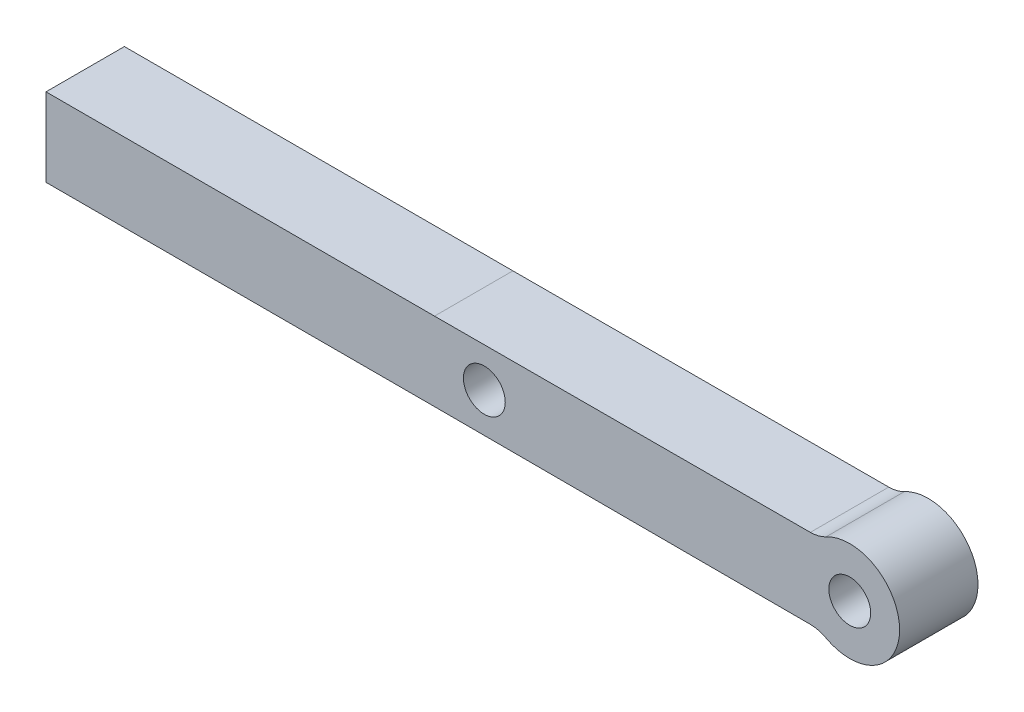
ISO-10303-21;
HEADER;
FILE_DESCRIPTION(('STEP AP214'),'2;1');
FILE_NAME('part.step','',(''),(''),'','','');
FILE_SCHEMA(('AUTOMOTIVE_DESIGN { 1 0 10303 214 1 1 1 1 }'));
ENDSEC;
DATA;
#1=APPLICATION_CONTEXT('core data for automotive mechanical design processes');
#2=APPLICATION_PROTOCOL_DEFINITION('international standard','automotive_design',2000,#1);
#3=PRODUCT_CONTEXT('',#1,'mechanical');
#4=PRODUCT('Part','Part','',(#3));
#5=PRODUCT_RELATED_PRODUCT_CATEGORY('part','',(#4));
#6=PRODUCT_DEFINITION_FORMATION('','',#4);
#7=PRODUCT_DEFINITION_CONTEXT('part definition',#1,'design');
#8=PRODUCT_DEFINITION('design','',#6,#7);
#9=PRODUCT_DEFINITION_SHAPE('','',#8);
#10=(LENGTH_UNIT() NAMED_UNIT(*) SI_UNIT(.MILLI.,.METRE.));
#11=(NAMED_UNIT(*) PLANE_ANGLE_UNIT() SI_UNIT($,.RADIAN.));
#12=(NAMED_UNIT(*) SI_UNIT($,.STERADIAN.) SOLID_ANGLE_UNIT());
#13=UNCERTAINTY_MEASURE_WITH_UNIT(LENGTH_MEASURE(1.E-05),#10,'distance_accuracy_value','');
#14=(GEOMETRIC_REPRESENTATION_CONTEXT(3) GLOBAL_UNCERTAINTY_ASSIGNED_CONTEXT((#13)) GLOBAL_UNIT_ASSIGNED_CONTEXT((#10,
#11,#12)) REPRESENTATION_CONTEXT('',''));
#15=CARTESIAN_POINT('',(0.,0.,0.));
#16=DIRECTION('',(0.,0.,1.));
#17=DIRECTION('',(1.,0.,0.));
#18=AXIS2_PLACEMENT_3D('',#15,#16,#17);
#19=CARTESIAN_POINT('',(-3.01841433356619,5.586740991931,5.9944));
#20=DIRECTION('',(0.,0.,-1.));
#21=DIRECTION('',(-1.,0.,0.));
#22=AXIS2_PLACEMENT_3D('',#19,#20,#21);
#23=PLANE('',#22);
#24=CARTESIAN_POINT('',(-3.01841433356619,5.586740991931,5.9944));
#25=DIRECTION('',(0.,0.,-1.));
#26=DIRECTION('',(-1.,0.,0.));
#27=AXIS2_PLACEMENT_3D('',#24,#25,#26);
#28=CIRCLE('',#27,2.54);
#29=CARTESIAN_POINT('',(-1.81104860013972,3.3520445951586,5.9944));
#30=VERTEX_POINT('',#29);
#31=CARTESIAN_POINT('',(-3.01403502973043,3.04674476719012,5.9944));
#32=VERTEX_POINT('',#31);
#33=EDGE_CURVE('E147',#30,#32,#28,.T.);
#34=ORIENTED_EDGE('',*,*,#33,.T.);
#35=DIRECTION('',(-0.999998513677511,-0.0017241353684095,0.));
#36=VECTOR('',#35,1.);
#37=CARTESIAN_POINT('',(-31.75,2.9972,5.9944));
#38=LINE('',#37,#36);
#39=CARTESIAN_POINT('',(-31.75,2.9972,5.9944));
#40=VERTEX_POINT('',#39);
#41=EDGE_CURVE('E93',#32,#40,#38,.T.);
#42=ORIENTED_EDGE('',*,*,#41,.T.);
#43=DIRECTION('',(-1.,0.,0.));
#44=VECTOR('',#43,1.);
#45=CARTESIAN_POINT('',(-31.75,2.9972,5.9944));
#46=LINE('',#45,#44);
#47=CARTESIAN_POINT('',(-61.4537217435414,2.9972,5.9944));
#48=VERTEX_POINT('',#47);
#49=EDGE_CURVE('E161',#40,#48,#46,.T.);
#50=ORIENTED_EDGE('',*,*,#49,.T.);
#51=DIRECTION('',(0.,-1.,0.));
#52=VECTOR('',#51,1.);
#53=CARTESIAN_POINT('',(-61.4537217435414,2.9972,5.9944));
#54=LINE('',#53,#52);
#55=CARTESIAN_POINT('',(-61.4537217435414,-2.9972,5.9944));
#56=VERTEX_POINT('',#55);
#57=EDGE_CURVE('E175',#48,#56,#54,.T.);
#58=ORIENTED_EDGE('',*,*,#57,.T.);
#59=DIRECTION('',(1.,0.,0.));
#60=VECTOR('',#59,1.);
#61=CARTESIAN_POINT('',(-61.4537217435414,-2.9972,5.9944));
#62=LINE('',#61,#60);
#63=CARTESIAN_POINT('',(-31.75,-2.9972,5.9944));
#64=VERTEX_POINT('',#63);
#65=EDGE_CURVE('E112',#56,#64,#62,.T.);
#66=ORIENTED_EDGE('',*,*,#65,.T.);
#67=DIRECTION('',(0.999998513677511,-0.0017241353684095,0.));
#68=VECTOR('',#67,1.);
#69=CARTESIAN_POINT('',(-31.75,-2.9972,5.9944));
#70=LINE('',#69,#68);
#71=CARTESIAN_POINT('',(-3.01403502973043,-3.04674476719012,5.9944));
#72=VERTEX_POINT('',#71);
#73=EDGE_CURVE('E106',#64,#72,#70,.T.);
#74=ORIENTED_EDGE('',*,*,#73,.T.);
#75=CARTESIAN_POINT('',(-3.01841433356619,-5.586740991931,5.9944));
#76=DIRECTION('',(0.,0.,-1.));
#77=DIRECTION('',(1.,0.,0.));
#78=AXIS2_PLACEMENT_3D('',#75,#76,#77);
#79=CIRCLE('',#78,2.54);
#80=CARTESIAN_POINT('',(-1.81104860013972,-3.3520445951586,5.9944));
#81=VERTEX_POINT('',#80);
#82=EDGE_CURVE('E110',#72,#81,#79,.T.);
#83=ORIENTED_EDGE('',*,*,#82,.T.);
#84=CARTESIAN_POINT('',(0.,0.,5.9944));
#85=DIRECTION('',(0.,0.,1.));
#86=DIRECTION('',(1.,0.,0.));
#87=AXIS2_PLACEMENT_3D('',#84,#85,#86);
#88=CIRCLE('',#87,3.81);
#89=EDGE_CURVE('E50',#81,#30,#88,.T.);
#90=ORIENTED_EDGE('',*,*,#89,.T.);
#91=EDGE_LOOP('',(#34,#42,#50,#58,#66,#74,#83,#90));
#92=FACE_BOUND('',#91,.T.);
#93=CARTESIAN_POINT('',(0.,0.,5.9944));
#94=DIRECTION('',(0.,0.,1.));
#95=DIRECTION('',(1.,0.,0.));
#96=AXIS2_PLACEMENT_3D('',#93,#94,#95);
#97=CIRCLE('',#96,1.6);
#98=CARTESIAN_POINT('',(1.6,0.,5.9944));
#99=VERTEX_POINT('',#98);
#100=EDGE_CURVE('E134',#99,#99,#97,.T.);
#101=ORIENTED_EDGE('',*,*,#100,.F.);
#102=EDGE_LOOP('',(#101));
#103=FACE_BOUND('',#102,.T.);
#104=CARTESIAN_POINT('',(-27.94,0.,5.9944));
#105=DIRECTION('',(0.,0.,1.));
#106=DIRECTION('',(1.,0.,0.));
#107=AXIS2_PLACEMENT_3D('',#104,#105,#106);
#108=CIRCLE('',#107,1.6);
#109=CARTESIAN_POINT('',(-26.34,0.,5.9944));
#110=VERTEX_POINT('',#109);
#111=EDGE_CURVE('E184',#110,#110,#108,.T.);
#112=ORIENTED_EDGE('',*,*,#111,.F.);
#113=EDGE_LOOP('',(#112));
#114=FACE_BOUND('',#113,.T.);
#115=ADVANCED_FACE('F33',(#92,#103,#114),#23,.F.);
#116=CARTESIAN_POINT('',(-3.01841433356619,5.586740991931,0.));
#117=DIRECTION('',(0.,0.,-1.));
#118=DIRECTION('',(-1.,0.,0.));
#119=AXIS2_PLACEMENT_3D('',#116,#117,#118);
#120=PLANE('',#119);
#121=CARTESIAN_POINT('',(0.,0.,0.));
#122=DIRECTION('',(0.,0.,1.));
#123=DIRECTION('',(1.,0.,0.));
#124=AXIS2_PLACEMENT_3D('',#121,#122,#123);
#125=CIRCLE('',#124,1.6);
#126=CARTESIAN_POINT('',(1.6,0.,0.));
#127=VERTEX_POINT('',#126);
#128=EDGE_CURVE('E181',#127,#127,#125,.T.);
#129=ORIENTED_EDGE('',*,*,#128,.T.);
#130=EDGE_LOOP('',(#129));
#131=FACE_BOUND('',#130,.T.);
#132=CARTESIAN_POINT('',(-3.01841433356619,5.586740991931,0.));
#133=DIRECTION('',(0.,0.,-1.));
#134=DIRECTION('',(-1.,0.,0.));
#135=AXIS2_PLACEMENT_3D('',#132,#133,#134);
#136=CIRCLE('',#135,2.54);
#137=CARTESIAN_POINT('',(-1.81104860013972,3.3520445951586,0.));
#138=VERTEX_POINT('',#137);
#139=CARTESIAN_POINT('',(-3.01403502973043,3.04674476719012,0.));
#140=VERTEX_POINT('',#139);
#141=EDGE_CURVE('E130',#138,#140,#136,.T.);
#142=ORIENTED_EDGE('',*,*,#141,.F.);
#143=CARTESIAN_POINT('',(0.,0.,0.));
#144=DIRECTION('',(0.,0.,1.));
#145=DIRECTION('',(1.,0.,0.));
#146=AXIS2_PLACEMENT_3D('',#143,#144,#145);
#147=CIRCLE('',#146,3.81);
#148=CARTESIAN_POINT('',(-1.81104860013972,-3.3520445951586,0.));
#149=VERTEX_POINT('',#148);
#150=EDGE_CURVE('E85',#149,#138,#147,.T.);
#151=ORIENTED_EDGE('',*,*,#150,.F.);
#152=CARTESIAN_POINT('',(-3.01841433356619,-5.586740991931,0.));
#153=DIRECTION('',(0.,0.,-1.));
#154=DIRECTION('',(1.,0.,0.));
#155=AXIS2_PLACEMENT_3D('',#152,#153,#154);
#156=CIRCLE('',#155,2.54);
#157=CARTESIAN_POINT('',(-3.01403502973043,-3.04674476719012,0.));
#158=VERTEX_POINT('',#157);
#159=EDGE_CURVE('E79',#158,#149,#156,.T.);
#160=ORIENTED_EDGE('',*,*,#159,.F.);
#161=DIRECTION('',(0.999998513677511,-0.0017241353684095,0.));
#162=VECTOR('',#161,1.);
#163=CARTESIAN_POINT('',(-31.75,-2.9972,0.));
#164=LINE('',#163,#162);
#165=CARTESIAN_POINT('',(-31.75,-2.9972,0.));
#166=VERTEX_POINT('',#165);
#167=EDGE_CURVE('E120',#166,#158,#164,.T.);
#168=ORIENTED_EDGE('',*,*,#167,.F.);
#169=DIRECTION('',(1.,0.,0.));
#170=VECTOR('',#169,1.);
#171=CARTESIAN_POINT('',(-37.7444,-2.9972,0.));
#172=LINE('',#171,#170);
#173=CARTESIAN_POINT('',(-61.4537217435414,-2.9972,0.));
#174=VERTEX_POINT('',#173);
#175=EDGE_CURVE('E142',#174,#166,#172,.T.);
#176=ORIENTED_EDGE('',*,*,#175,.F.);
#177=DIRECTION('',(0.,-1.,0.));
#178=VECTOR('',#177,1.);
#179=CARTESIAN_POINT('',(-61.4537217435414,2.9972,0.));
#180=LINE('',#179,#178);
#181=CARTESIAN_POINT('',(-61.4537217435414,2.9972,0.));
#182=VERTEX_POINT('',#181);
#183=EDGE_CURVE('E139',#182,#174,#180,.T.);
#184=ORIENTED_EDGE('',*,*,#183,.F.);
#185=DIRECTION('',(-1.,0.,0.));
#186=VECTOR('',#185,1.);
#187=CARTESIAN_POINT('',(-42.4037217435414,2.9972,0.));
#188=LINE('',#187,#186);
#189=CARTESIAN_POINT('',(-31.75,2.9972,0.));
#190=VERTEX_POINT('',#189);
#191=EDGE_CURVE('E137',#190,#182,#188,.T.);
#192=ORIENTED_EDGE('',*,*,#191,.F.);
#193=DIRECTION('',(-0.999998513677511,-0.0017241353684095,0.));
#194=VECTOR('',#193,1.);
#195=CARTESIAN_POINT('',(-31.75,2.9972,0.));
#196=LINE('',#195,#194);
#197=EDGE_CURVE('E133',#140,#190,#196,.T.);
#198=ORIENTED_EDGE('',*,*,#197,.F.);
#199=EDGE_LOOP('',(#142,#151,#160,#168,#176,#184,#192,#198));
#200=FACE_BOUND('',#199,.T.);
#201=CARTESIAN_POINT('',(-27.94,0.,0.));
#202=DIRECTION('',(0.,0.,1.));
#203=DIRECTION('',(1.,0.,0.));
#204=AXIS2_PLACEMENT_3D('',#201,#202,#203);
#205=CIRCLE('',#204,1.6);
#206=CARTESIAN_POINT('',(-26.34,0.,0.));
#207=VERTEX_POINT('',#206);
#208=EDGE_CURVE('E187',#207,#207,#205,.T.);
#209=ORIENTED_EDGE('',*,*,#208,.T.);
#210=EDGE_LOOP('',(#209));
#211=FACE_BOUND('',#210,.T.);
#212=ADVANCED_FACE('F166',(#131,#200,#211),#120,.T.);
#213=CARTESIAN_POINT('',(-3.01841433356619,5.586740991931,5.9944));
#214=DIRECTION('',(0.,0.,-1.));
#215=DIRECTION('',(-1.,0.,0.));
#216=AXIS2_PLACEMENT_3D('',#213,#214,#215);
#217=CYLINDRICAL_SURFACE('',#216,2.54);
#218=ORIENTED_EDGE('',*,*,#141,.T.);
#219=DIRECTION('',(0.,0.,-1.));
#220=VECTOR('',#219,1.);
#221=CARTESIAN_POINT('',(-3.01403502973043,3.04674476719012,5.9944));
#222=LINE('',#221,#220);
#223=EDGE_CURVE('E11',#32,#140,#222,.T.);
#224=ORIENTED_EDGE('',*,*,#223,.F.);
#225=ORIENTED_EDGE('',*,*,#33,.F.);
#226=DIRECTION('',(0.,0.,-1.));
#227=VECTOR('',#226,1.);
#228=CARTESIAN_POINT('',(-1.81104860013972,3.3520445951586,5.9944));
#229=LINE('',#228,#227);
#230=EDGE_CURVE('E126',#30,#138,#229,.T.);
#231=ORIENTED_EDGE('',*,*,#230,.T.);
#232=EDGE_LOOP('',(#218,#224,#225,#231));
#233=FACE_BOUND('',#232,.T.);
#234=ADVANCED_FACE('F35',(#233),#217,.F.);
#235=CARTESIAN_POINT('',(-31.75,2.9972,5.9944));
#236=DIRECTION('',(0.0017241353684095,-0.999998513677511,0.));
#237=DIRECTION('',(0.999998513677511,0.0017241353684095,0.));
#238=AXIS2_PLACEMENT_3D('',#235,#236,#237);
#239=PLANE('',#238);
#240=ORIENTED_EDGE('',*,*,#197,.T.);
#241=DIRECTION('',(0.,0.,-1.));
#242=VECTOR('',#241,1.);
#243=CARTESIAN_POINT('',(-31.75,2.9972,5.9944));
#244=LINE('',#243,#242);
#245=EDGE_CURVE('E42',#40,#190,#244,.T.);
#246=ORIENTED_EDGE('',*,*,#245,.F.);
#247=ORIENTED_EDGE('',*,*,#41,.F.);
#248=ORIENTED_EDGE('',*,*,#223,.T.);
#249=EDGE_LOOP('',(#240,#246,#247,#248));
#250=FACE_BOUND('',#249,.T.);
#251=ADVANCED_FACE('F162',(#250),#239,.F.);
#252=CARTESIAN_POINT('',(-42.4037217435414,2.9972,5.9944));
#253=DIRECTION('',(0.,-1.,0.));
#254=DIRECTION('',(1.,0.,0.));
#255=AXIS2_PLACEMENT_3D('',#252,#253,#254);
#256=PLANE('',#255);
#257=ORIENTED_EDGE('',*,*,#191,.T.);
#258=DIRECTION('',(0.,0.,-1.));
#259=VECTOR('',#258,1.);
#260=CARTESIAN_POINT('',(-61.4537217435414,2.9972,5.9944));
#261=LINE('',#260,#259);
#262=EDGE_CURVE('E154',#48,#182,#261,.T.);
#263=ORIENTED_EDGE('',*,*,#262,.F.);
#264=ORIENTED_EDGE('',*,*,#49,.F.);
#265=ORIENTED_EDGE('',*,*,#245,.T.);
#266=EDGE_LOOP('',(#257,#263,#264,#265));
#267=FACE_BOUND('',#266,.T.);
#268=ADVANCED_FACE('F159',(#267),#256,.F.);
#269=CARTESIAN_POINT('',(-61.4537217435414,2.9972,5.9944));
#270=DIRECTION('',(1.,0.,0.));
#271=DIRECTION('',(0.,0.,-1.));
#272=AXIS2_PLACEMENT_3D('',#269,#270,#271);
#273=PLANE('',#272);
#274=ORIENTED_EDGE('',*,*,#183,.T.);
#275=DIRECTION('',(0.,0.,-1.));
#276=VECTOR('',#275,1.);
#277=CARTESIAN_POINT('',(-61.4537217435414,-2.9972,5.9944));
#278=LINE('',#277,#276);
#279=EDGE_CURVE('E151',#56,#174,#278,.T.);
#280=ORIENTED_EDGE('',*,*,#279,.F.);
#281=ORIENTED_EDGE('',*,*,#57,.F.);
#282=ORIENTED_EDGE('',*,*,#262,.T.);
#283=EDGE_LOOP('',(#274,#280,#281,#282));
#284=FACE_BOUND('',#283,.T.);
#285=ADVANCED_FACE('F171',(#284),#273,.F.);
#286=CARTESIAN_POINT('',(-37.7444,-2.9972,5.9944));
#287=DIRECTION('',(0.,1.,0.));
#288=DIRECTION('',(0.,0.,1.));
#289=AXIS2_PLACEMENT_3D('',#286,#287,#288);
#290=PLANE('',#289);
#291=ORIENTED_EDGE('',*,*,#175,.T.);
#292=DIRECTION('',(0.,0.,-1.));
#293=VECTOR('',#292,1.);
#294=CARTESIAN_POINT('',(-31.75,-2.9972,5.9944));
#295=LINE('',#294,#293);
#296=EDGE_CURVE('E121',#64,#166,#295,.T.);
#297=ORIENTED_EDGE('',*,*,#296,.F.);
#298=ORIENTED_EDGE('',*,*,#65,.F.);
#299=ORIENTED_EDGE('',*,*,#279,.T.);
#300=EDGE_LOOP('',(#291,#297,#298,#299));
#301=FACE_BOUND('',#300,.T.);
#302=ADVANCED_FACE('F174',(#301),#290,.F.);
#303=CARTESIAN_POINT('',(-31.75,-2.9972,5.9944));
#304=DIRECTION('',(0.0017241353684095,0.999998513677511,0.));
#305=DIRECTION('',(-0.999998513677511,0.0017241353684095,0.));
#306=AXIS2_PLACEMENT_3D('',#303,#304,#305);
#307=PLANE('',#306);
#308=ORIENTED_EDGE('',*,*,#167,.T.);
#309=DIRECTION('',(0.,0.,-1.));
#310=VECTOR('',#309,1.);
#311=CARTESIAN_POINT('',(-3.01403502973043,-3.04674476719012,5.9944));
#312=LINE('',#311,#310);
#313=EDGE_CURVE('E117',#72,#158,#312,.T.);
#314=ORIENTED_EDGE('',*,*,#313,.F.);
#315=ORIENTED_EDGE('',*,*,#73,.F.);
#316=ORIENTED_EDGE('',*,*,#296,.T.);
#317=EDGE_LOOP('',(#308,#314,#315,#316));
#318=FACE_BOUND('',#317,.T.);
#319=ADVANCED_FACE('F118',(#318),#307,.F.);
#320=CARTESIAN_POINT('',(-3.01841433356619,-5.586740991931,5.9944));
#321=DIRECTION('',(0.,0.,-1.));
#322=DIRECTION('',(-1.,0.,0.));
#323=AXIS2_PLACEMENT_3D('',#320,#321,#322);
#324=CYLINDRICAL_SURFACE('',#323,2.54);
#325=ORIENTED_EDGE('',*,*,#159,.T.);
#326=DIRECTION('',(0.,0.,-1.));
#327=VECTOR('',#326,1.);
#328=CARTESIAN_POINT('',(-1.81104860013972,-3.3520445951586,5.9944));
#329=LINE('',#328,#327);
#330=EDGE_CURVE('E122',#81,#149,#329,.T.);
#331=ORIENTED_EDGE('',*,*,#330,.F.);
#332=ORIENTED_EDGE('',*,*,#82,.F.);
#333=ORIENTED_EDGE('',*,*,#313,.T.);
#334=EDGE_LOOP('',(#325,#331,#332,#333));
#335=FACE_BOUND('',#334,.T.);
#336=ADVANCED_FACE('F124',(#335),#324,.F.);
#337=CARTESIAN_POINT('',(0.,0.,5.9944));
#338=DIRECTION('',(0.,0.,-1.));
#339=DIRECTION('',(-1.,0.,0.));
#340=AXIS2_PLACEMENT_3D('',#337,#338,#339);
#341=CYLINDRICAL_SURFACE('',#340,3.81);
#342=ORIENTED_EDGE('',*,*,#150,.T.);
#343=ORIENTED_EDGE('',*,*,#230,.F.);
#344=ORIENTED_EDGE('',*,*,#89,.F.);
#345=ORIENTED_EDGE('',*,*,#330,.T.);
#346=EDGE_LOOP('',(#342,#343,#344,#345));
#347=FACE_BOUND('',#346,.T.);
#348=ADVANCED_FACE('F207',(#347),#341,.T.);
#349=CARTESIAN_POINT('',(0.,0.,5.9944));
#350=DIRECTION('',(0.,0.,-1.));
#351=DIRECTION('',(-1.,0.,0.));
#352=AXIS2_PLACEMENT_3D('',#349,#350,#351);
#353=CYLINDRICAL_SURFACE('',#352,1.6);
#354=ORIENTED_EDGE('',*,*,#100,.T.);
#355=EDGE_LOOP('',(#354));
#356=FACE_BOUND('',#355,.T.);
#357=ORIENTED_EDGE('',*,*,#128,.F.);
#358=EDGE_LOOP('',(#357));
#359=FACE_BOUND('',#358,.T.);
#360=ADVANCED_FACE('F204',(#356,#359),#353,.F.);
#361=CARTESIAN_POINT('',(-27.94,0.,5.9944));
#362=DIRECTION('',(0.,0.,-1.));
#363=DIRECTION('',(-1.,0.,0.));
#364=AXIS2_PLACEMENT_3D('',#361,#362,#363);
#365=CYLINDRICAL_SURFACE('',#364,1.6);
#366=ORIENTED_EDGE('',*,*,#111,.T.);
#367=EDGE_LOOP('',(#366));
#368=FACE_BOUND('',#367,.T.);
#369=ORIENTED_EDGE('',*,*,#208,.F.);
#370=EDGE_LOOP('',(#369));
#371=FACE_BOUND('',#370,.T.);
#372=ADVANCED_FACE('F193',(#368,#371),#365,.F.);
#373=CLOSED_SHELL('',(#115,#212,#234,#251,#268,#285,#302,#319,#336,#348,#360,#372));
#374=MANIFOLD_SOLID_BREP('B2',#373);
#375=ADVANCED_BREP_SHAPE_REPRESENTATION('',(#18,#374),#14);
#376=SHAPE_DEFINITION_REPRESENTATION(#9,#375);
ENDSEC;
END-ISO-10303-21;
